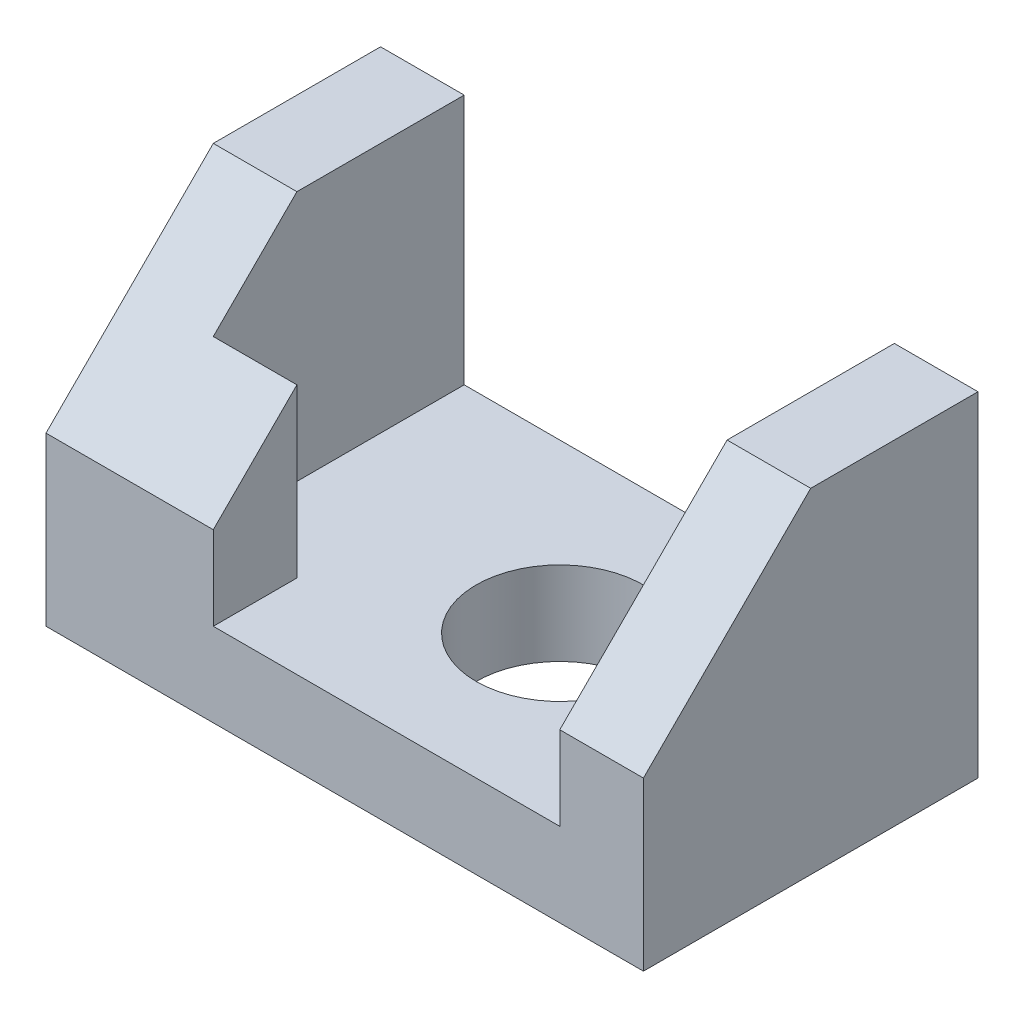
ISO-10303-21;
HEADER;
FILE_DESCRIPTION(('STEP AP214'),'2;1');
FILE_NAME('part.step','',(''),(''),'','','');
FILE_SCHEMA(('AUTOMOTIVE_DESIGN { 1 0 10303 214 1 1 1 1 }'));
ENDSEC;
DATA;
#1=APPLICATION_CONTEXT('core data for automotive mechanical design processes');
#2=APPLICATION_PROTOCOL_DEFINITION('international standard','automotive_design',2000,#1);
#3=PRODUCT_CONTEXT('',#1,'mechanical');
#4=PRODUCT('Part','Part','',(#3));
#5=PRODUCT_RELATED_PRODUCT_CATEGORY('part','',(#4));
#6=PRODUCT_DEFINITION_FORMATION('','',#4);
#7=PRODUCT_DEFINITION_CONTEXT('part definition',#1,'design');
#8=PRODUCT_DEFINITION('design','',#6,#7);
#9=PRODUCT_DEFINITION_SHAPE('','',#8);
#10=(LENGTH_UNIT() NAMED_UNIT(*) SI_UNIT(.MILLI.,.METRE.));
#11=(NAMED_UNIT(*) PLANE_ANGLE_UNIT() SI_UNIT($,.RADIAN.));
#12=(NAMED_UNIT(*) SI_UNIT($,.STERADIAN.) SOLID_ANGLE_UNIT());
#13=UNCERTAINTY_MEASURE_WITH_UNIT(LENGTH_MEASURE(1.E-05),#10,'distance_accuracy_value','');
#14=(GEOMETRIC_REPRESENTATION_CONTEXT(3) GLOBAL_UNCERTAINTY_ASSIGNED_CONTEXT((#13)) GLOBAL_UNIT_ASSIGNED_CONTEXT((#10,
#11,#12)) REPRESENTATION_CONTEXT('',''));
#15=CARTESIAN_POINT('',(0.,0.,0.));
#16=DIRECTION('',(0.,0.,1.));
#17=DIRECTION('',(1.,0.,0.));
#18=AXIS2_PLACEMENT_3D('',#15,#16,#17);
#19=CARTESIAN_POINT('',(0.,7.,14.));
#20=DIRECTION('',(0.,0.,-1.));
#21=DIRECTION('',(-1.,0.,0.));
#22=AXIS2_PLACEMENT_3D('',#19,#20,#21);
#23=PLANE('',#22);
#24=DIRECTION('',(0.,-1.,0.));
#25=VECTOR('',#24,1.);
#26=CARTESIAN_POINT('',(-11.,28.,14.));
#27=LINE('',#26,#25);
#28=CARTESIAN_POINT('',(-11.,13.9999999999999,14.));
#29=VERTEX_POINT('',#28);
#30=CARTESIAN_POINT('',(-11.,7.,14.));
#31=VERTEX_POINT('',#30);
#32=EDGE_CURVE('E172',#29,#31,#27,.T.);
#33=ORIENTED_EDGE('',*,*,#32,.F.);
#34=DIRECTION('',(-1.,0.,0.));
#35=VECTOR('',#34,1.);
#36=CARTESIAN_POINT('',(-25.,13.9999999999999,14.));
#37=LINE('',#36,#35);
#38=CARTESIAN_POINT('',(-25.,13.9999999999999,14.));
#39=VERTEX_POINT('',#38);
#40=EDGE_CURVE('E227',#29,#39,#37,.T.);
#41=ORIENTED_EDGE('',*,*,#40,.T.);
#42=DIRECTION('',(0.,-1.,0.));
#43=VECTOR('',#42,1.);
#44=CARTESIAN_POINT('',(-25.,28.,14.));
#45=LINE('',#44,#43);
#46=CARTESIAN_POINT('',(-25.,0.,14.));
#47=VERTEX_POINT('',#46);
#48=EDGE_CURVE('E176',#39,#47,#45,.T.);
#49=ORIENTED_EDGE('',*,*,#48,.T.);
#50=DIRECTION('',(1.,0.,0.));
#51=VECTOR('',#50,1.);
#52=CARTESIAN_POINT('',(0.,0.,14.));
#53=LINE('',#52,#51);
#54=CARTESIAN_POINT('',(25.,0.,14.));
#55=VERTEX_POINT('',#54);
#56=EDGE_CURVE('E213',#47,#55,#53,.T.);
#57=ORIENTED_EDGE('',*,*,#56,.T.);
#58=DIRECTION('',(0.,-1.,0.));
#59=VECTOR('',#58,1.);
#60=CARTESIAN_POINT('',(25.,28.,14.));
#61=LINE('',#60,#59);
#62=CARTESIAN_POINT('',(25.,13.9999999999999,14.));
#63=VERTEX_POINT('',#62);
#64=EDGE_CURVE('E148',#63,#55,#61,.T.);
#65=ORIENTED_EDGE('',*,*,#64,.F.);
#66=DIRECTION('',(-1.,0.,0.));
#67=VECTOR('',#66,1.);
#68=CARTESIAN_POINT('',(18.,13.9999999999999,14.));
#69=LINE('',#68,#67);
#70=CARTESIAN_POINT('',(18.,13.9999999999999,14.));
#71=VERTEX_POINT('',#70);
#72=EDGE_CURVE('E225',#63,#71,#69,.T.);
#73=ORIENTED_EDGE('',*,*,#72,.T.);
#74=DIRECTION('',(0.,-1.,0.));
#75=VECTOR('',#74,1.);
#76=CARTESIAN_POINT('',(18.,28.,14.));
#77=LINE('',#76,#75);
#78=CARTESIAN_POINT('',(18.,7.,14.));
#79=VERTEX_POINT('',#78);
#80=EDGE_CURVE('E156',#71,#79,#77,.T.);
#81=ORIENTED_EDGE('',*,*,#80,.T.);
#82=DIRECTION('',(1.,0.,0.));
#83=VECTOR('',#82,1.);
#84=CARTESIAN_POINT('',(0.,7.,14.));
#85=LINE('',#84,#83);
#86=EDGE_CURVE('E199',#31,#79,#85,.T.);
#87=ORIENTED_EDGE('',*,*,#86,.F.);
#88=EDGE_LOOP('',(#33,#41,#49,#57,#65,#73,#81,#87));
#89=FACE_BOUND('',#88,.T.);
#90=ADVANCED_FACE('F43',(#89),#23,.F.);
#91=CARTESIAN_POINT('',(0.,7.,-14.));
#92=DIRECTION('',(0.,0.,-1.));
#93=DIRECTION('',(-1.,0.,0.));
#94=AXIS2_PLACEMENT_3D('',#91,#92,#93);
#95=PLANE('',#94);
#96=DIRECTION('',(1.,0.,0.));
#97=VECTOR('',#96,1.);
#98=CARTESIAN_POINT('',(0.,0.,-14.));
#99=LINE('',#98,#97);
#100=CARTESIAN_POINT('',(-25.,0.,-14.));
#101=VERTEX_POINT('',#100);
#102=CARTESIAN_POINT('',(25.,0.,-14.));
#103=VERTEX_POINT('',#102);
#104=EDGE_CURVE('E193',#101,#103,#99,.T.);
#105=ORIENTED_EDGE('',*,*,#104,.F.);
#106=DIRECTION('',(0.,-1.,0.));
#107=VECTOR('',#106,1.);
#108=CARTESIAN_POINT('',(-25.,28.,-14.));
#109=LINE('',#108,#107);
#110=CARTESIAN_POINT('',(-25.,28.,-14.));
#111=VERTEX_POINT('',#110);
#112=EDGE_CURVE('E178',#111,#101,#109,.T.);
#113=ORIENTED_EDGE('',*,*,#112,.F.);
#114=DIRECTION('',(1.,0.,0.));
#115=VECTOR('',#114,1.);
#116=CARTESIAN_POINT('',(0.,28.,-14.));
#117=LINE('',#116,#115);
#118=CARTESIAN_POINT('',(-18.,28.,-14.));
#119=VERTEX_POINT('',#118);
#120=EDGE_CURVE('E167',#111,#119,#117,.T.);
#121=ORIENTED_EDGE('',*,*,#120,.T.);
#122=DIRECTION('',(0.,-1.,0.));
#123=VECTOR('',#122,1.);
#124=CARTESIAN_POINT('',(-18.,28.,-14.));
#125=LINE('',#124,#123);
#126=CARTESIAN_POINT('',(-18.,7.,-14.));
#127=VERTEX_POINT('',#126);
#128=EDGE_CURVE('E181',#119,#127,#125,.T.);
#129=ORIENTED_EDGE('',*,*,#128,.T.);
#130=DIRECTION('',(1.,0.,0.));
#131=VECTOR('',#130,1.);
#132=CARTESIAN_POINT('',(0.,7.,-14.));
#133=LINE('',#132,#131);
#134=CARTESIAN_POINT('',(18.,7.,-14.));
#135=VERTEX_POINT('',#134);
#136=EDGE_CURVE('E205',#127,#135,#133,.T.);
#137=ORIENTED_EDGE('',*,*,#136,.T.);
#138=DIRECTION('',(0.,-1.,0.));
#139=VECTOR('',#138,1.);
#140=CARTESIAN_POINT('',(18.,28.,-14.));
#141=LINE('',#140,#139);
#142=CARTESIAN_POINT('',(18.,28.,-14.));
#143=VERTEX_POINT('',#142);
#144=EDGE_CURVE('E149',#143,#135,#141,.T.);
#145=ORIENTED_EDGE('',*,*,#144,.F.);
#146=DIRECTION('',(1.,0.,0.));
#147=VECTOR('',#146,1.);
#148=CARTESIAN_POINT('',(0.,28.,-14.));
#149=LINE('',#148,#147);
#150=CARTESIAN_POINT('',(25.,28.,-14.));
#151=VERTEX_POINT('',#150);
#152=EDGE_CURVE('E137',#143,#151,#149,.T.);
#153=ORIENTED_EDGE('',*,*,#152,.T.);
#154=DIRECTION('',(0.,-1.,0.));
#155=VECTOR('',#154,1.);
#156=CARTESIAN_POINT('',(25.,28.,-14.));
#157=LINE('',#156,#155);
#158=EDGE_CURVE('E144',#151,#103,#157,.T.);
#159=ORIENTED_EDGE('',*,*,#158,.T.);
#160=EDGE_LOOP('',(#105,#113,#121,#129,#137,#145,#153,#159));
#161=FACE_BOUND('',#160,.T.);
#162=ADVANCED_FACE('F151',(#161),#95,.T.);
#163=CARTESIAN_POINT('',(4.,7.,0.));
#164=DIRECTION('',(0.,-1.,0.));
#165=DIRECTION('',(0.,0.,-1.));
#166=AXIS2_PLACEMENT_3D('',#163,#164,#165);
#167=CYLINDRICAL_SURFACE('',#166,7.);
#168=CARTESIAN_POINT('',(4.,7.,0.));
#169=DIRECTION('',(0.,1.,0.));
#170=DIRECTION('',(0.,0.,1.));
#171=AXIS2_PLACEMENT_3D('',#168,#169,#170);
#172=CIRCLE('',#171,7.);
#173=CARTESIAN_POINT('',(4.,7.,7.));
#174=VERTEX_POINT('',#173);
#175=EDGE_CURVE('E189',#174,#174,#172,.T.);
#176=ORIENTED_EDGE('',*,*,#175,.T.);
#177=EDGE_LOOP('',(#176));
#178=FACE_BOUND('',#177,.T.);
#179=CARTESIAN_POINT('',(4.,0.,0.));
#180=DIRECTION('',(0.,1.,0.));
#181=DIRECTION('',(0.,0.,1.));
#182=AXIS2_PLACEMENT_3D('',#179,#180,#181);
#183=CIRCLE('',#182,7.);
#184=CARTESIAN_POINT('',(4.,0.,7.));
#185=VERTEX_POINT('',#184);
#186=EDGE_CURVE('E188',#185,#185,#183,.T.);
#187=ORIENTED_EDGE('',*,*,#186,.F.);
#188=EDGE_LOOP('',(#187));
#189=FACE_BOUND('',#188,.T.);
#190=ADVANCED_FACE('F248',(#178,#189),#167,.F.);
#191=CARTESIAN_POINT('',(0.,7.,0.));
#192=DIRECTION('',(0.,1.,0.));
#193=DIRECTION('',(0.,0.,1.));
#194=AXIS2_PLACEMENT_3D('',#191,#192,#193);
#195=PLANE('',#194);
#196=ORIENTED_EDGE('',*,*,#175,.F.);
#197=EDGE_LOOP('',(#196));
#198=FACE_BOUND('',#197,.T.);
#199=DIRECTION('',(1.,0.,0.));
#200=VECTOR('',#199,1.);
#201=CARTESIAN_POINT('',(0.,7.,7.));
#202=LINE('',#201,#200);
#203=CARTESIAN_POINT('',(-18.,7.,7.));
#204=VERTEX_POINT('',#203);
#205=CARTESIAN_POINT('',(-11.,7.,7.));
#206=VERTEX_POINT('',#205);
#207=EDGE_CURVE('E192',#204,#206,#202,.T.);
#208=ORIENTED_EDGE('',*,*,#207,.T.);
#209=DIRECTION('',(0.,0.,1.));
#210=VECTOR('',#209,1.);
#211=CARTESIAN_POINT('',(-11.,7.,0.));
#212=LINE('',#211,#210);
#213=EDGE_CURVE('E196',#206,#31,#212,.T.);
#214=ORIENTED_EDGE('',*,*,#213,.T.);
#215=ORIENTED_EDGE('',*,*,#86,.T.);
#216=DIRECTION('',(0.,0.,1.));
#217=VECTOR('',#216,1.);
#218=CARTESIAN_POINT('',(18.,7.,0.));
#219=LINE('',#218,#217);
#220=EDGE_CURVE('E202',#135,#79,#219,.T.);
#221=ORIENTED_EDGE('',*,*,#220,.F.);
#222=ORIENTED_EDGE('',*,*,#136,.F.);
#223=DIRECTION('',(0.,0.,1.));
#224=VECTOR('',#223,1.);
#225=CARTESIAN_POINT('',(-18.,7.,0.));
#226=LINE('',#225,#224);
#227=EDGE_CURVE('E207',#127,#204,#226,.T.);
#228=ORIENTED_EDGE('',*,*,#227,.T.);
#229=EDGE_LOOP('',(#208,#214,#215,#221,#222,#228));
#230=FACE_BOUND('',#229,.T.);
#231=ADVANCED_FACE('F253',(#198,#230),#195,.T.);
#232=CARTESIAN_POINT('',(0.,0.,0.));
#233=DIRECTION('',(0.,1.,0.));
#234=DIRECTION('',(0.,0.,1.));
#235=AXIS2_PLACEMENT_3D('',#232,#233,#234);
#236=PLANE('',#235);
#237=ORIENTED_EDGE('',*,*,#56,.F.);
#238=DIRECTION('',(0.,0.,-1.));
#239=VECTOR('',#238,1.);
#240=CARTESIAN_POINT('',(-25.,0.,0.));
#241=LINE('',#240,#239);
#242=EDGE_CURVE('E163',#47,#101,#241,.T.);
#243=ORIENTED_EDGE('',*,*,#242,.T.);
#244=ORIENTED_EDGE('',*,*,#104,.T.);
#245=DIRECTION('',(0.,0.,-1.));
#246=VECTOR('',#245,1.);
#247=CARTESIAN_POINT('',(25.,0.,0.));
#248=LINE('',#247,#246);
#249=EDGE_CURVE('E140',#55,#103,#248,.T.);
#250=ORIENTED_EDGE('',*,*,#249,.F.);
#251=EDGE_LOOP('',(#237,#243,#244,#250));
#252=FACE_BOUND('',#251,.T.);
#253=ORIENTED_EDGE('',*,*,#186,.T.);
#254=EDGE_LOOP('',(#253));
#255=FACE_BOUND('',#254,.T.);
#256=ADVANCED_FACE('F263',(#252,#255),#236,.F.);
#257=CARTESIAN_POINT('',(-11.,28.,0.));
#258=DIRECTION('',(1.,0.,0.));
#259=DIRECTION('',(0.,0.,-1.));
#260=AXIS2_PLACEMENT_3D('',#257,#258,#259);
#261=PLANE('',#260);
#262=DIRECTION('',(0.,-1.,0.));
#263=VECTOR('',#262,1.);
#264=CARTESIAN_POINT('',(-11.,28.,7.));
#265=LINE('',#264,#263);
#266=CARTESIAN_POINT('',(-11.,21.,7.));
#267=VERTEX_POINT('',#266);
#268=EDGE_CURVE('E186',#267,#206,#265,.T.);
#269=ORIENTED_EDGE('',*,*,#268,.F.);
#270=DIRECTION('',(0.,-0.707106781186548,0.707106781186548));
#271=VECTOR('',#270,1.);
#272=CARTESIAN_POINT('',(-11.,28.,0.));
#273=LINE('',#272,#271);
#274=EDGE_CURVE('E223',#267,#29,#273,.T.);
#275=ORIENTED_EDGE('',*,*,#274,.T.);
#276=ORIENTED_EDGE('',*,*,#32,.T.);
#277=ORIENTED_EDGE('',*,*,#213,.F.);
#278=EDGE_LOOP('',(#269,#275,#276,#277));
#279=FACE_BOUND('',#278,.T.);
#280=ADVANCED_FACE('F270',(#279),#261,.T.);
#281=CARTESIAN_POINT('',(0.,28.,7.));
#282=DIRECTION('',(0.,0.,-1.));
#283=DIRECTION('',(-1.,0.,0.));
#284=AXIS2_PLACEMENT_3D('',#281,#282,#283);
#285=PLANE('',#284);
#286=DIRECTION('',(0.,-1.,0.));
#287=VECTOR('',#286,1.);
#288=CARTESIAN_POINT('',(-18.,28.,7.));
#289=LINE('',#288,#287);
#290=CARTESIAN_POINT('',(-18.,21.,7.));
#291=VERTEX_POINT('',#290);
#292=EDGE_CURVE('E184',#291,#204,#289,.T.);
#293=ORIENTED_EDGE('',*,*,#292,.F.);
#294=DIRECTION('',(1.,0.,0.));
#295=VECTOR('',#294,1.);
#296=CARTESIAN_POINT('',(0.,21.,7.));
#297=LINE('',#296,#295);
#298=EDGE_CURVE('E221',#291,#267,#297,.T.);
#299=ORIENTED_EDGE('',*,*,#298,.T.);
#300=ORIENTED_EDGE('',*,*,#268,.T.);
#301=ORIENTED_EDGE('',*,*,#207,.F.);
#302=EDGE_LOOP('',(#293,#299,#300,#301));
#303=FACE_BOUND('',#302,.T.);
#304=ADVANCED_FACE('F274',(#303),#285,.T.);
#305=CARTESIAN_POINT('',(-18.,28.,0.));
#306=DIRECTION('',(1.,0.,0.));
#307=DIRECTION('',(0.,0.,-1.));
#308=AXIS2_PLACEMENT_3D('',#305,#306,#307);
#309=PLANE('',#308);
#310=DIRECTION('',(0.,0.,1.));
#311=VECTOR('',#310,1.);
#312=CARTESIAN_POINT('',(-18.,28.,0.));
#313=LINE('',#312,#311);
#314=CARTESIAN_POINT('',(-18.,28.,0.));
#315=VERTEX_POINT('',#314);
#316=EDGE_CURVE('E164',#119,#315,#313,.T.);
#317=ORIENTED_EDGE('',*,*,#316,.T.);
#318=DIRECTION('',(0.,-0.707106781186548,0.707106781186548));
#319=VECTOR('',#318,1.);
#320=CARTESIAN_POINT('',(-18.,28.,0.));
#321=LINE('',#320,#319);
#322=EDGE_CURVE('E219',#315,#291,#321,.T.);
#323=ORIENTED_EDGE('',*,*,#322,.T.);
#324=ORIENTED_EDGE('',*,*,#292,.T.);
#325=ORIENTED_EDGE('',*,*,#227,.F.);
#326=ORIENTED_EDGE('',*,*,#128,.F.);
#327=EDGE_LOOP('',(#317,#323,#324,#325,#326));
#328=FACE_BOUND('',#327,.T.);
#329=ADVANCED_FACE('F280',(#328),#309,.T.);
#330=CARTESIAN_POINT('',(-25.,28.,0.));
#331=DIRECTION('',(-1.,0.,0.));
#332=DIRECTION('',(0.,0.,1.));
#333=AXIS2_PLACEMENT_3D('',#330,#331,#332);
#334=PLANE('',#333);
#335=ORIENTED_EDGE('',*,*,#48,.F.);
#336=DIRECTION('',(0.,0.707106781186548,-0.707106781186548));
#337=VECTOR('',#336,1.);
#338=CARTESIAN_POINT('',(-25.,28.,0.));
#339=LINE('',#338,#337);
#340=CARTESIAN_POINT('',(-25.,28.,0.));
#341=VERTEX_POINT('',#340);
#342=EDGE_CURVE('E229',#39,#341,#339,.T.);
#343=ORIENTED_EDGE('',*,*,#342,.T.);
#344=DIRECTION('',(0.,0.,-1.));
#345=VECTOR('',#344,1.);
#346=CARTESIAN_POINT('',(-25.,28.,0.));
#347=LINE('',#346,#345);
#348=EDGE_CURVE('E170',#341,#111,#347,.T.);
#349=ORIENTED_EDGE('',*,*,#348,.T.);
#350=ORIENTED_EDGE('',*,*,#112,.T.);
#351=ORIENTED_EDGE('',*,*,#242,.F.);
#352=EDGE_LOOP('',(#335,#343,#349,#350,#351));
#353=FACE_BOUND('',#352,.T.);
#354=ADVANCED_FACE('F284',(#353),#334,.T.);
#355=CARTESIAN_POINT('',(0.,28.,0.));
#356=DIRECTION('',(0.,1.,0.));
#357=DIRECTION('',(0.,0.,1.));
#358=AXIS2_PLACEMENT_3D('',#355,#356,#357);
#359=PLANE('',#358);
#360=ORIENTED_EDGE('',*,*,#348,.F.);
#361=DIRECTION('',(1.,0.,0.));
#362=VECTOR('',#361,1.);
#363=CARTESIAN_POINT('',(-11.,28.,0.));
#364=LINE('',#363,#362);
#365=EDGE_CURVE('E210',#341,#315,#364,.T.);
#366=ORIENTED_EDGE('',*,*,#365,.T.);
#367=ORIENTED_EDGE('',*,*,#316,.F.);
#368=ORIENTED_EDGE('',*,*,#120,.F.);
#369=EDGE_LOOP('',(#360,#366,#367,#368));
#370=FACE_BOUND('',#369,.T.);
#371=ADVANCED_FACE('F288',(#370),#359,.T.);
#372=CARTESIAN_POINT('',(18.,28.,0.));
#373=DIRECTION('',(1.,0.,0.));
#374=DIRECTION('',(0.,0.,-1.));
#375=AXIS2_PLACEMENT_3D('',#372,#373,#374);
#376=PLANE('',#375);
#377=ORIENTED_EDGE('',*,*,#80,.F.);
#378=DIRECTION('',(0.,0.707106781186548,-0.707106781186548));
#379=VECTOR('',#378,1.);
#380=CARTESIAN_POINT('',(18.,28.,0.));
#381=LINE('',#380,#379);
#382=CARTESIAN_POINT('',(18.,28.,0.));
#383=VERTEX_POINT('',#382);
#384=EDGE_CURVE('E11',#71,#383,#381,.T.);
#385=ORIENTED_EDGE('',*,*,#384,.T.);
#386=DIRECTION('',(0.,0.,1.));
#387=VECTOR('',#386,1.);
#388=CARTESIAN_POINT('',(18.,28.,0.));
#389=LINE('',#388,#387);
#390=EDGE_CURVE('E154',#143,#383,#389,.T.);
#391=ORIENTED_EDGE('',*,*,#390,.F.);
#392=ORIENTED_EDGE('',*,*,#144,.T.);
#393=ORIENTED_EDGE('',*,*,#220,.T.);
#394=EDGE_LOOP('',(#377,#385,#391,#392,#393));
#395=FACE_BOUND('',#394,.T.);
#396=ADVANCED_FACE('F292',(#395),#376,.F.);
#397=CARTESIAN_POINT('',(25.,28.,0.));
#398=DIRECTION('',(-1.,0.,0.));
#399=DIRECTION('',(0.,0.,1.));
#400=AXIS2_PLACEMENT_3D('',#397,#398,#399);
#401=PLANE('',#400);
#402=DIRECTION('',(0.,0.,-1.));
#403=VECTOR('',#402,1.);
#404=CARTESIAN_POINT('',(25.,28.,0.));
#405=LINE('',#404,#403);
#406=CARTESIAN_POINT('',(25.,28.,0.));
#407=VERTEX_POINT('',#406);
#408=EDGE_CURVE('E133',#407,#151,#405,.T.);
#409=ORIENTED_EDGE('',*,*,#408,.F.);
#410=DIRECTION('',(0.,-0.707106781186548,0.707106781186548));
#411=VECTOR('',#410,1.);
#412=CARTESIAN_POINT('',(25.,28.,0.));
#413=LINE('',#412,#411);
#414=EDGE_CURVE('E52',#407,#63,#413,.T.);
#415=ORIENTED_EDGE('',*,*,#414,.T.);
#416=ORIENTED_EDGE('',*,*,#64,.T.);
#417=ORIENTED_EDGE('',*,*,#249,.T.);
#418=ORIENTED_EDGE('',*,*,#158,.F.);
#419=EDGE_LOOP('',(#409,#415,#416,#417,#418));
#420=FACE_BOUND('',#419,.T.);
#421=ADVANCED_FACE('F145',(#420),#401,.F.);
#422=CARTESIAN_POINT('',(0.,28.,0.));
#423=DIRECTION('',(0.,1.,0.));
#424=DIRECTION('',(0.,0.,1.));
#425=AXIS2_PLACEMENT_3D('',#422,#423,#424);
#426=PLANE('',#425);
#427=ORIENTED_EDGE('',*,*,#390,.T.);
#428=DIRECTION('',(1.,0.,0.));
#429=VECTOR('',#428,1.);
#430=CARTESIAN_POINT('',(25.,28.,0.));
#431=LINE('',#430,#429);
#432=EDGE_CURVE('E138',#383,#407,#431,.T.);
#433=ORIENTED_EDGE('',*,*,#432,.T.);
#434=ORIENTED_EDGE('',*,*,#408,.T.);
#435=ORIENTED_EDGE('',*,*,#152,.F.);
#436=EDGE_LOOP('',(#427,#433,#434,#435));
#437=FACE_BOUND('',#436,.T.);
#438=ADVANCED_FACE('F135',(#437),#426,.T.);
#439=CARTESIAN_POINT('',(0.,28.,0.));
#440=DIRECTION('',(0.,0.707106781186548,0.707106781186548));
#441=DIRECTION('',(-1.,0.,0.));
#442=AXIS2_PLACEMENT_3D('',#439,#440,#441);
#443=PLANE('',#442);
#444=ORIENTED_EDGE('',*,*,#342,.F.);
#445=ORIENTED_EDGE('',*,*,#40,.F.);
#446=ORIENTED_EDGE('',*,*,#274,.F.);
#447=ORIENTED_EDGE('',*,*,#298,.F.);
#448=ORIENTED_EDGE('',*,*,#322,.F.);
#449=ORIENTED_EDGE('',*,*,#365,.F.);
#450=EDGE_LOOP('',(#444,#445,#446,#447,#448,#449));
#451=FACE_BOUND('',#450,.T.);
#452=ADVANCED_FACE('F236',(#451),#443,.T.);
#453=CARTESIAN_POINT('',(0.,28.,0.));
#454=DIRECTION('',(0.,0.707106781186548,0.707106781186548));
#455=DIRECTION('',(-1.,0.,0.));
#456=AXIS2_PLACEMENT_3D('',#453,#454,#455);
#457=PLANE('',#456);
#458=ORIENTED_EDGE('',*,*,#384,.F.);
#459=ORIENTED_EDGE('',*,*,#72,.F.);
#460=ORIENTED_EDGE('',*,*,#414,.F.);
#461=ORIENTED_EDGE('',*,*,#432,.F.);
#462=EDGE_LOOP('',(#458,#459,#460,#461));
#463=FACE_BOUND('',#462,.T.);
#464=ADVANCED_FACE('F46',(#463),#457,.T.);
#465=CLOSED_SHELL('',(#90,#162,#190,#231,#256,#280,#304,#329,#354,#371,#396,#421,#438,#452,#464));
#466=MANIFOLD_SOLID_BREP('B2',#465);
#467=ADVANCED_BREP_SHAPE_REPRESENTATION('',(#18,#466),#14);
#468=SHAPE_DEFINITION_REPRESENTATION(#9,#467);
ENDSEC;
END-ISO-10303-21;
